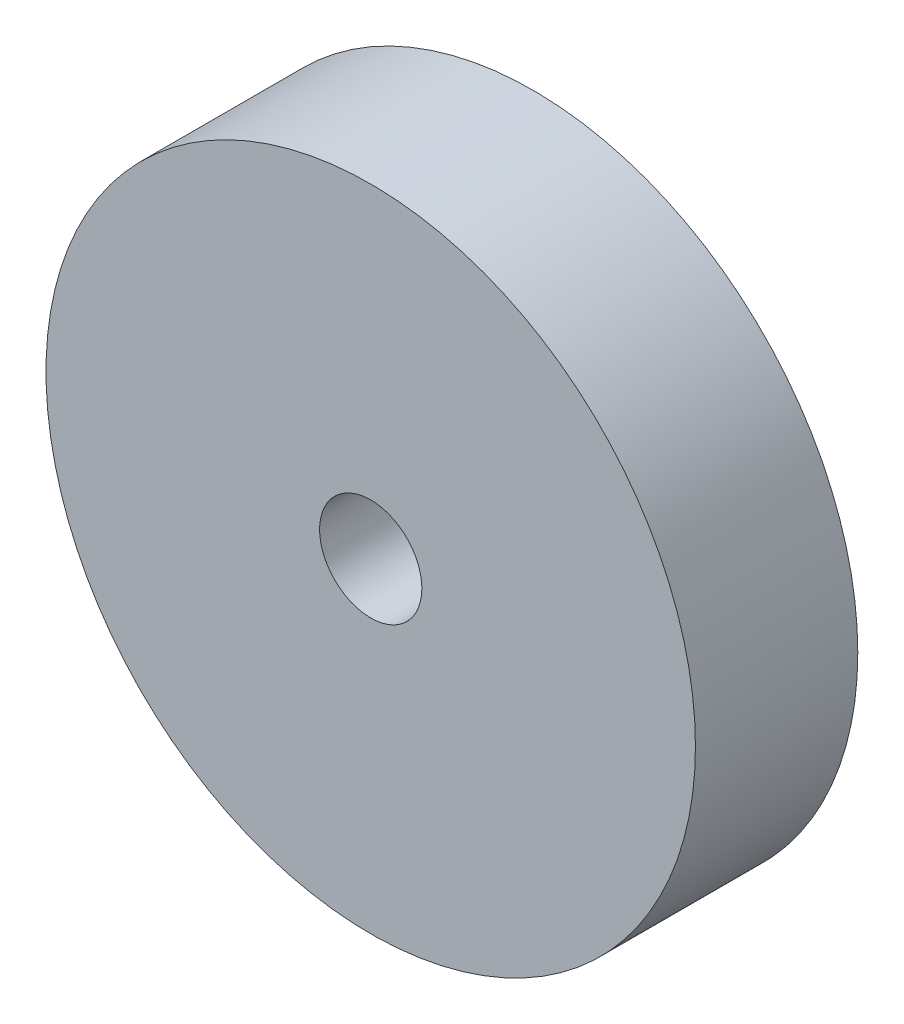
ISO-10303-21;
HEADER;
FILE_DESCRIPTION(('STEP AP214'),'2;1');
FILE_NAME('part.step','',(''),(''),'','','');
FILE_SCHEMA(('AUTOMOTIVE_DESIGN { 1 0 10303 214 1 1 1 1 }'));
ENDSEC;
DATA;
#1=APPLICATION_CONTEXT('core data for automotive mechanical design processes');
#2=APPLICATION_PROTOCOL_DEFINITION('international standard','automotive_design',2000,#1);
#3=PRODUCT_CONTEXT('',#1,'mechanical');
#4=PRODUCT('Part','Part','',(#3));
#5=PRODUCT_RELATED_PRODUCT_CATEGORY('part','',(#4));
#6=PRODUCT_DEFINITION_FORMATION('','',#4);
#7=PRODUCT_DEFINITION_CONTEXT('part definition',#1,'design');
#8=PRODUCT_DEFINITION('design','',#6,#7);
#9=PRODUCT_DEFINITION_SHAPE('','',#8);
#10=(LENGTH_UNIT() NAMED_UNIT(*) SI_UNIT(.MILLI.,.METRE.));
#11=(NAMED_UNIT(*) PLANE_ANGLE_UNIT() SI_UNIT($,.RADIAN.));
#12=(NAMED_UNIT(*) SI_UNIT($,.STERADIAN.) SOLID_ANGLE_UNIT());
#13=UNCERTAINTY_MEASURE_WITH_UNIT(LENGTH_MEASURE(1.E-05),#10,'distance_accuracy_value','');
#14=(GEOMETRIC_REPRESENTATION_CONTEXT(3) GLOBAL_UNCERTAINTY_ASSIGNED_CONTEXT((#13)) GLOBAL_UNIT_ASSIGNED_CONTEXT((#10,
#11,#12)) REPRESENTATION_CONTEXT('',''));
#15=CARTESIAN_POINT('',(0.,0.,0.));
#16=DIRECTION('',(0.,0.,1.));
#17=DIRECTION('',(1.,0.,0.));
#18=AXIS2_PLACEMENT_3D('',#15,#16,#17);
#19=CARTESIAN_POINT('',(0.,0.,12.7));
#20=DIRECTION('',(0.,0.,1.));
#21=DIRECTION('',(1.,0.,0.));
#22=AXIS2_PLACEMENT_3D('',#19,#20,#21);
#23=PLANE('',#22);
#24=CARTESIAN_POINT('',(0.,0.,12.7));
#25=DIRECTION('',(0.,0.,1.));
#26=DIRECTION('',(1.,0.,0.));
#27=AXIS2_PLACEMENT_3D('',#24,#25,#26);
#28=CIRCLE('',#27,25.4);
#29=CARTESIAN_POINT('',(25.4,0.,12.7));
#30=VERTEX_POINT('',#29);
#31=EDGE_CURVE('E12',#30,#30,#28,.T.);
#32=ORIENTED_EDGE('',*,*,#31,.T.);
#33=EDGE_LOOP('',(#32));
#34=FACE_BOUND('',#33,.T.);
#35=CARTESIAN_POINT('',(0.,0.,12.7));
#36=DIRECTION('',(0.,0.,1.));
#37=DIRECTION('',(1.,0.,0.));
#38=AXIS2_PLACEMENT_3D('',#35,#36,#37);
#39=CIRCLE('',#38,4.);
#40=CARTESIAN_POINT('',(4.,0.,12.7));
#41=VERTEX_POINT('',#40);
#42=EDGE_CURVE('E53',#41,#41,#39,.T.);
#43=ORIENTED_EDGE('',*,*,#42,.F.);
#44=EDGE_LOOP('',(#43));
#45=FACE_BOUND('',#44,.T.);
#46=ADVANCED_FACE('F42',(#34,#45),#23,.T.);
#47=CARTESIAN_POINT('',(0.,0.,0.));
#48=DIRECTION('',(0.,0.,1.));
#49=DIRECTION('',(1.,0.,0.));
#50=AXIS2_PLACEMENT_3D('',#47,#48,#49);
#51=PLANE('',#50);
#52=CARTESIAN_POINT('',(0.,0.,0.));
#53=DIRECTION('',(0.,0.,1.));
#54=DIRECTION('',(1.,0.,0.));
#55=AXIS2_PLACEMENT_3D('',#52,#53,#54);
#56=CIRCLE('',#55,25.4);
#57=CARTESIAN_POINT('',(25.4,0.,0.));
#58=VERTEX_POINT('',#57);
#59=EDGE_CURVE('E46',#58,#58,#56,.T.);
#60=ORIENTED_EDGE('',*,*,#59,.F.);
#61=EDGE_LOOP('',(#60));
#62=FACE_BOUND('',#61,.T.);
#63=CARTESIAN_POINT('',(0.,0.,0.));
#64=DIRECTION('',(0.,0.,1.));
#65=DIRECTION('',(1.,0.,0.));
#66=AXIS2_PLACEMENT_3D('',#63,#64,#65);
#67=CIRCLE('',#66,4.);
#68=CARTESIAN_POINT('',(4.,0.,0.));
#69=VERTEX_POINT('',#68);
#70=EDGE_CURVE('E55',#69,#69,#67,.T.);
#71=ORIENTED_EDGE('',*,*,#70,.T.);
#72=EDGE_LOOP('',(#71));
#73=FACE_BOUND('',#72,.T.);
#74=ADVANCED_FACE('F65',(#62,#73),#51,.F.);
#75=CARTESIAN_POINT('',(0.,0.,12.7));
#76=DIRECTION('',(0.,0.,-1.));
#77=DIRECTION('',(-1.,0.,0.));
#78=AXIS2_PLACEMENT_3D('',#75,#76,#77);
#79=CYLINDRICAL_SURFACE('',#78,25.4);
#80=ORIENTED_EDGE('',*,*,#31,.F.);
#81=EDGE_LOOP('',(#80));
#82=FACE_BOUND('',#81,.T.);
#83=ORIENTED_EDGE('',*,*,#59,.T.);
#84=EDGE_LOOP('',(#83));
#85=FACE_BOUND('',#84,.T.);
#86=ADVANCED_FACE('F44',(#82,#85),#79,.T.);
#87=CARTESIAN_POINT('',(0.,0.,12.7));
#88=DIRECTION('',(0.,0.,-1.));
#89=DIRECTION('',(-1.,0.,0.));
#90=AXIS2_PLACEMENT_3D('',#87,#88,#89);
#91=CYLINDRICAL_SURFACE('',#90,4.);
#92=ORIENTED_EDGE('',*,*,#42,.T.);
#93=EDGE_LOOP('',(#92));
#94=FACE_BOUND('',#93,.T.);
#95=ORIENTED_EDGE('',*,*,#70,.F.);
#96=EDGE_LOOP('',(#95));
#97=FACE_BOUND('',#96,.T.);
#98=ADVANCED_FACE('F61',(#94,#97),#91,.F.);
#99=CLOSED_SHELL('',(#46,#74,#86,#98));
#100=MANIFOLD_SOLID_BREP('B2',#99);
#101=ADVANCED_BREP_SHAPE_REPRESENTATION('',(#18,#100),#14);
#102=SHAPE_DEFINITION_REPRESENTATION(#9,#101);
ENDSEC;
END-ISO-10303-21;
